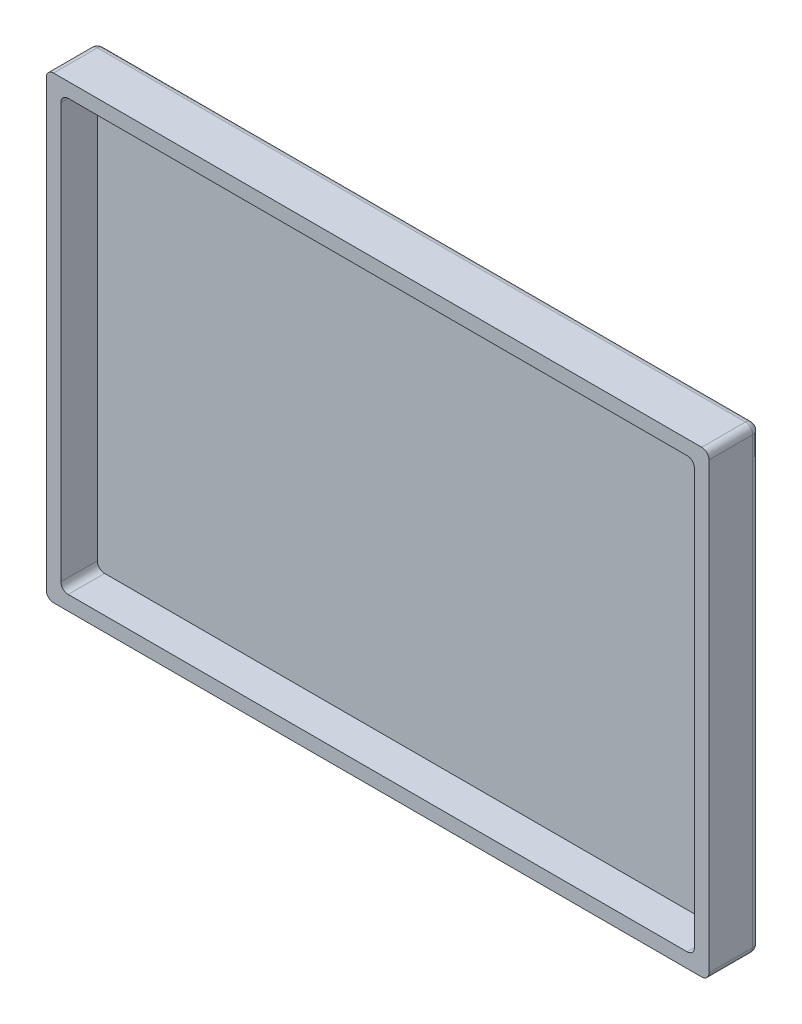
ISO-10303-21;
HEADER;
FILE_DESCRIPTION(('STEP AP214'),'2;1');
FILE_NAME('part.step','',(''),(''),'','','');
FILE_SCHEMA(('AUTOMOTIVE_DESIGN { 1 0 10303 214 1 1 1 1 }'));
ENDSEC;
DATA;
#1=APPLICATION_CONTEXT('core data for automotive mechanical design processes');
#2=APPLICATION_PROTOCOL_DEFINITION('international standard','automotive_design',2000,#1);
#3=PRODUCT_CONTEXT('',#1,'mechanical');
#4=PRODUCT('Part','Part','',(#3));
#5=PRODUCT_RELATED_PRODUCT_CATEGORY('part','',(#4));
#6=PRODUCT_DEFINITION_FORMATION('','',#4);
#7=PRODUCT_DEFINITION_CONTEXT('part definition',#1,'design');
#8=PRODUCT_DEFINITION('design','',#6,#7);
#9=PRODUCT_DEFINITION_SHAPE('','',#8);
#10=(LENGTH_UNIT() NAMED_UNIT(*) SI_UNIT(.MILLI.,.METRE.));
#11=(NAMED_UNIT(*) PLANE_ANGLE_UNIT() SI_UNIT($,.RADIAN.));
#12=(NAMED_UNIT(*) SI_UNIT($,.STERADIAN.) SOLID_ANGLE_UNIT());
#13=UNCERTAINTY_MEASURE_WITH_UNIT(LENGTH_MEASURE(1.E-05),#10,'distance_accuracy_value','');
#14=(GEOMETRIC_REPRESENTATION_CONTEXT(3) GLOBAL_UNCERTAINTY_ASSIGNED_CONTEXT((#13)) GLOBAL_UNIT_ASSIGNED_CONTEXT((#10,
#11,#12)) REPRESENTATION_CONTEXT('',''));
#15=CARTESIAN_POINT('',(0.,0.,0.));
#16=DIRECTION('',(0.,0.,1.));
#17=DIRECTION('',(1.,0.,0.));
#18=AXIS2_PLACEMENT_3D('',#15,#16,#17);
#19=CARTESIAN_POINT('',(0.,0.,5.));
#20=DIRECTION('',(0.,0.,1.));
#21=DIRECTION('',(1.,0.,0.));
#22=AXIS2_PLACEMENT_3D('',#19,#20,#21);
#23=PLANE('',#22);
#24=DIRECTION('',(1.,0.,0.));
#25=VECTOR('',#24,1.);
#26=CARTESIAN_POINT('',(-46.7633401137233,-46.7014218009479,5.));
#27=LINE('',#26,#25);
#28=CARTESIAN_POINT('',(-45.7633401137233,-46.7014218009479,5.));
#29=VERTEX_POINT('',#28);
#30=CARTESIAN_POINT('',(43.2366598862767,-46.7014218009479,5.));
#31=VERTEX_POINT('',#30);
#32=EDGE_CURVE('E367',#29,#31,#27,.T.);
#33=ORIENTED_EDGE('',*,*,#32,.T.);
#34=CARTESIAN_POINT('',(43.2366598862767,-45.7014218009479,5.));
#35=DIRECTION('',(0.,0.,1.));
#36=DIRECTION('',(1.,0.,0.));
#37=AXIS2_PLACEMENT_3D('',#34,#35,#36);
#38=CIRCLE('',#37,1.);
#39=CARTESIAN_POINT('',(44.2366598862767,-45.7014218009479,5.));
#40=VERTEX_POINT('',#39);
#41=EDGE_CURVE('E273',#31,#40,#38,.T.);
#42=ORIENTED_EDGE('',*,*,#41,.T.);
#43=DIRECTION('',(0.,1.,0.));
#44=VECTOR('',#43,1.);
#45=CARTESIAN_POINT('',(44.2366598862767,16.2985781990521,5.));
#46=LINE('',#45,#44);
#47=CARTESIAN_POINT('',(44.2366598862767,15.2985781990521,5.));
#48=VERTEX_POINT('',#47);
#49=EDGE_CURVE('E200',#40,#48,#46,.T.);
#50=ORIENTED_EDGE('',*,*,#49,.T.);
#51=CARTESIAN_POINT('',(43.2366598862767,15.2985781990521,5.));
#52=DIRECTION('',(0.,0.,1.));
#53=DIRECTION('',(1.,0.,0.));
#54=AXIS2_PLACEMENT_3D('',#51,#52,#53);
#55=CIRCLE('',#54,1.);
#56=CARTESIAN_POINT('',(43.2366598862767,16.2985781990521,5.));
#57=VERTEX_POINT('',#56);
#58=EDGE_CURVE('E270',#48,#57,#55,.T.);
#59=ORIENTED_EDGE('',*,*,#58,.T.);
#60=DIRECTION('',(-1.,0.,0.));
#61=VECTOR('',#60,1.);
#62=CARTESIAN_POINT('',(-46.7633401137233,16.2985781990521,5.));
#63=LINE('',#62,#61);
#64=CARTESIAN_POINT('',(-45.7633401137233,16.2985781990521,5.));
#65=VERTEX_POINT('',#64);
#66=EDGE_CURVE('E196',#57,#65,#63,.T.);
#67=ORIENTED_EDGE('',*,*,#66,.T.);
#68=CARTESIAN_POINT('',(-45.7633401137233,15.2985781990521,5.));
#69=DIRECTION('',(0.,0.,1.));
#70=DIRECTION('',(1.,0.,0.));
#71=AXIS2_PLACEMENT_3D('',#68,#69,#70);
#72=CIRCLE('',#71,1.);
#73=CARTESIAN_POINT('',(-46.7633401137233,15.2985781990521,5.));
#74=VERTEX_POINT('',#73);
#75=EDGE_CURVE('E267',#65,#74,#72,.T.);
#76=ORIENTED_EDGE('',*,*,#75,.T.);
#77=DIRECTION('',(0.,-1.,0.));
#78=VECTOR('',#77,1.);
#79=CARTESIAN_POINT('',(-46.7633401137233,16.2985781990521,5.));
#80=LINE('',#79,#78);
#81=CARTESIAN_POINT('',(-46.7633401137233,-45.7014218009479,5.));
#82=VERTEX_POINT('',#81);
#83=EDGE_CURVE('E363',#74,#82,#80,.T.);
#84=ORIENTED_EDGE('',*,*,#83,.T.);
#85=CARTESIAN_POINT('',(-45.7633401137233,-45.7014218009479,5.));
#86=DIRECTION('',(0.,0.,1.));
#87=DIRECTION('',(1.,0.,0.));
#88=AXIS2_PLACEMENT_3D('',#85,#86,#87);
#89=CIRCLE('',#88,1.);
#90=EDGE_CURVE('E254',#82,#29,#89,.T.);
#91=ORIENTED_EDGE('',*,*,#90,.T.);
#92=EDGE_LOOP('',(#33,#42,#50,#59,#67,#76,#84,#91));
#93=FACE_BOUND('',#92,.T.);
#94=DIRECTION('',(1.,0.,0.));
#95=VECTOR('',#94,1.);
#96=CARTESIAN_POINT('',(-44.7633401137233,-44.7014218009479,5.));
#97=LINE('',#96,#95);
#98=CARTESIAN_POINT('',(-43.7633401137233,-44.7014218009479,5.));
#99=VERTEX_POINT('',#98);
#100=CARTESIAN_POINT('',(41.2366598862767,-44.7014218009479,5.));
#101=VERTEX_POINT('',#100);
#102=EDGE_CURVE('E686',#99,#101,#97,.T.);
#103=ORIENTED_EDGE('',*,*,#102,.F.);
#104=CARTESIAN_POINT('',(-43.7633401137233,-43.7014218009479,5.));
#105=DIRECTION('',(0.,0.,1.));
#106=DIRECTION('',(1.,0.,0.));
#107=AXIS2_PLACEMENT_3D('',#104,#105,#106);
#108=CIRCLE('',#107,1.);
#109=CARTESIAN_POINT('',(-44.7633401137233,-43.7014218009478,5.));
#110=VERTEX_POINT('',#109);
#111=EDGE_CURVE('E241',#99,#110,#108,.F.);
#112=ORIENTED_EDGE('',*,*,#111,.T.);
#113=DIRECTION('',(0.,-1.,0.));
#114=VECTOR('',#113,1.);
#115=CARTESIAN_POINT('',(-44.7633401137233,14.2985781990521,5.));
#116=LINE('',#115,#114);
#117=CARTESIAN_POINT('',(-44.7633401137233,13.2985781990521,5.));
#118=VERTEX_POINT('',#117);
#119=EDGE_CURVE('E362',#118,#110,#116,.T.);
#120=ORIENTED_EDGE('',*,*,#119,.F.);
#121=CARTESIAN_POINT('',(-43.7633401137233,13.2985781990521,5.));
#122=DIRECTION('',(0.,0.,1.));
#123=DIRECTION('',(1.,0.,0.));
#124=AXIS2_PLACEMENT_3D('',#121,#122,#123);
#125=CIRCLE('',#124,1.);
#126=CARTESIAN_POINT('',(-43.7633401137233,14.2985781990521,5.));
#127=VERTEX_POINT('',#126);
#128=EDGE_CURVE('E238',#118,#127,#125,.F.);
#129=ORIENTED_EDGE('',*,*,#128,.T.);
#130=DIRECTION('',(-1.,0.,0.));
#131=VECTOR('',#130,1.);
#132=CARTESIAN_POINT('',(-44.7633401137233,14.2985781990521,5.));
#133=LINE('',#132,#131);
#134=CARTESIAN_POINT('',(41.2366598862767,14.2985781990521,5.));
#135=VERTEX_POINT('',#134);
#136=EDGE_CURVE('E357',#135,#127,#133,.T.);
#137=ORIENTED_EDGE('',*,*,#136,.F.);
#138=CARTESIAN_POINT('',(41.2366598862767,13.2985781990521,5.));
#139=DIRECTION('',(0.,0.,1.));
#140=DIRECTION('',(1.,0.,0.));
#141=AXIS2_PLACEMENT_3D('',#138,#139,#140);
#142=CIRCLE('',#141,1.);
#143=CARTESIAN_POINT('',(42.2366598862767,13.2985781990521,5.));
#144=VERTEX_POINT('',#143);
#145=EDGE_CURVE('E206',#135,#144,#142,.F.);
#146=ORIENTED_EDGE('',*,*,#145,.T.);
#147=DIRECTION('',(0.,1.,0.));
#148=VECTOR('',#147,1.);
#149=CARTESIAN_POINT('',(42.2366598862767,14.2985781990521,5.));
#150=LINE('',#149,#148);
#151=CARTESIAN_POINT('',(42.2366598862767,-43.7014218009479,5.));
#152=VERTEX_POINT('',#151);
#153=EDGE_CURVE('E193',#152,#144,#150,.T.);
#154=ORIENTED_EDGE('',*,*,#153,.F.);
#155=CARTESIAN_POINT('',(41.2366598862767,-43.7014218009479,5.));
#156=DIRECTION('',(0.,0.,1.));
#157=DIRECTION('',(1.,0.,0.));
#158=AXIS2_PLACEMENT_3D('',#155,#156,#157);
#159=CIRCLE('',#158,1.);
#160=EDGE_CURVE('E244',#152,#101,#159,.F.);
#161=ORIENTED_EDGE('',*,*,#160,.T.);
#162=EDGE_LOOP('',(#103,#112,#120,#129,#137,#146,#154,#161));
#163=FACE_BOUND('',#162,.T.);
#164=ADVANCED_FACE('F41',(#93,#163),#23,.T.);
#165=CARTESIAN_POINT('',(-46.7633401137233,16.2985781990521,5.));
#166=DIRECTION('',(1.,0.,0.));
#167=DIRECTION('',(0.,1.,0.));
#168=AXIS2_PLACEMENT_3D('',#165,#166,#167);
#169=PLANE('',#168);
#170=DIRECTION('',(0.,0.,-1.));
#171=VECTOR('',#170,1.);
#172=CARTESIAN_POINT('',(-46.7633401137233,15.2985781990521,5.));
#173=LINE('',#172,#171);
#174=CARTESIAN_POINT('',(-46.7633401137233,15.2985781990521,-1.));
#175=VERTEX_POINT('',#174);
#176=EDGE_CURVE('E283',#74,#175,#173,.T.);
#177=ORIENTED_EDGE('',*,*,#176,.T.);
#178=DIRECTION('',(0.,1.,0.));
#179=VECTOR('',#178,1.);
#180=CARTESIAN_POINT('',(-46.7633401137233,-45.7014218009479,-1.));
#181=LINE('',#180,#179);
#182=CARTESIAN_POINT('',(-46.7633401137233,-45.7014218009479,-1.));
#183=VERTEX_POINT('',#182);
#184=EDGE_CURVE('E310',#175,#183,#181,.F.);
#185=ORIENTED_EDGE('',*,*,#184,.T.);
#186=DIRECTION('',(0.,0.,-1.));
#187=VECTOR('',#186,1.);
#188=CARTESIAN_POINT('',(-46.7633401137233,-45.7014218009479,5.));
#189=LINE('',#188,#187);
#190=EDGE_CURVE('E251',#183,#82,#189,.F.);
#191=ORIENTED_EDGE('',*,*,#190,.T.);
#192=ORIENTED_EDGE('',*,*,#83,.F.);
#193=EDGE_LOOP('',(#177,#185,#191,#192));
#194=FACE_BOUND('',#193,.T.);
#195=ADVANCED_FACE('F413',(#194),#169,.F.);
#196=CARTESIAN_POINT('',(-46.7633401137233,-46.7014218009479,5.));
#197=DIRECTION('',(0.,1.,0.));
#198=DIRECTION('',(0.,0.,1.));
#199=AXIS2_PLACEMENT_3D('',#196,#197,#198);
#200=PLANE('',#199);
#201=DIRECTION('',(0.,0.,-1.));
#202=VECTOR('',#201,1.);
#203=CARTESIAN_POINT('',(-45.7633401137233,-46.7014218009479,5.));
#204=LINE('',#203,#202);
#205=CARTESIAN_POINT('',(-45.7633401137233,-46.7014218009479,-1.));
#206=VERTEX_POINT('',#205);
#207=EDGE_CURVE('E247',#29,#206,#204,.T.);
#208=ORIENTED_EDGE('',*,*,#207,.T.);
#209=DIRECTION('',(-1.,0.,0.));
#210=VECTOR('',#209,1.);
#211=CARTESIAN_POINT('',(43.2366598862767,-46.7014218009479,-1.));
#212=LINE('',#211,#210);
#213=CARTESIAN_POINT('',(43.2366598862767,-46.7014218009479,-1.));
#214=VERTEX_POINT('',#213);
#215=EDGE_CURVE('E313',#206,#214,#212,.F.);
#216=ORIENTED_EDGE('',*,*,#215,.T.);
#217=DIRECTION('',(0.,0.,-1.));
#218=VECTOR('',#217,1.);
#219=CARTESIAN_POINT('',(43.2366598862767,-46.7014218009479,5.));
#220=LINE('',#219,#218);
#221=EDGE_CURVE('E264',#214,#31,#220,.F.);
#222=ORIENTED_EDGE('',*,*,#221,.T.);
#223=ORIENTED_EDGE('',*,*,#32,.F.);
#224=EDGE_LOOP('',(#208,#216,#222,#223));
#225=FACE_BOUND('',#224,.T.);
#226=ADVANCED_FACE('F421',(#225),#200,.F.);
#227=CARTESIAN_POINT('',(44.2366598862767,16.2985781990521,5.));
#228=DIRECTION('',(-1.,0.,0.));
#229=DIRECTION('',(0.,-1.,0.));
#230=AXIS2_PLACEMENT_3D('',#227,#228,#229);
#231=PLANE('',#230);
#232=DIRECTION('',(0.,0.,-1.));
#233=VECTOR('',#232,1.);
#234=CARTESIAN_POINT('',(44.2366598862767,-45.7014218009479,5.));
#235=LINE('',#234,#233);
#236=CARTESIAN_POINT('',(44.2366598862767,-45.7014218009479,-1.));
#237=VERTEX_POINT('',#236);
#238=EDGE_CURVE('E260',#40,#237,#235,.T.);
#239=ORIENTED_EDGE('',*,*,#238,.T.);
#240=DIRECTION('',(0.,-1.,0.));
#241=VECTOR('',#240,1.);
#242=CARTESIAN_POINT('',(44.2366598862767,15.2985781990521,-1.));
#243=LINE('',#242,#241);
#244=CARTESIAN_POINT('',(44.2366598862767,15.2985781990521,-1.));
#245=VERTEX_POINT('',#244);
#246=EDGE_CURVE('E51',#237,#245,#243,.F.);
#247=ORIENTED_EDGE('',*,*,#246,.T.);
#248=DIRECTION('',(0.,0.,-1.));
#249=VECTOR('',#248,1.);
#250=CARTESIAN_POINT('',(44.2366598862767,15.2985781990521,5.));
#251=LINE('',#250,#249);
#252=EDGE_CURVE('E257',#245,#48,#251,.F.);
#253=ORIENTED_EDGE('',*,*,#252,.T.);
#254=ORIENTED_EDGE('',*,*,#49,.F.);
#255=EDGE_LOOP('',(#239,#247,#253,#254));
#256=FACE_BOUND('',#255,.T.);
#257=ADVANCED_FACE('F447',(#256),#231,.F.);
#258=CARTESIAN_POINT('',(-46.7633401137233,16.2985781990521,5.));
#259=DIRECTION('',(0.,-1.,0.));
#260=DIRECTION('',(0.,0.,-1.));
#261=AXIS2_PLACEMENT_3D('',#258,#259,#260);
#262=PLANE('',#261);
#263=DIRECTION('',(0.,0.,-1.));
#264=VECTOR('',#263,1.);
#265=CARTESIAN_POINT('',(43.2366598862767,16.2985781990521,5.));
#266=LINE('',#265,#264);
#267=CARTESIAN_POINT('',(43.2366598862767,16.2985781990521,-1.));
#268=VERTEX_POINT('',#267);
#269=EDGE_CURVE('E279',#57,#268,#266,.T.);
#270=ORIENTED_EDGE('',*,*,#269,.T.);
#271=DIRECTION('',(1.,0.,0.));
#272=VECTOR('',#271,1.);
#273=CARTESIAN_POINT('',(-45.7633401137233,16.2985781990521,-1.));
#274=LINE('',#273,#272);
#275=CARTESIAN_POINT('',(-45.7633401137233,16.2985781990521,-1.));
#276=VERTEX_POINT('',#275);
#277=EDGE_CURVE('E11',#268,#276,#274,.F.);
#278=ORIENTED_EDGE('',*,*,#277,.T.);
#279=DIRECTION('',(0.,0.,-1.));
#280=VECTOR('',#279,1.);
#281=CARTESIAN_POINT('',(-45.7633401137233,16.2985781990521,5.));
#282=LINE('',#281,#280);
#283=EDGE_CURVE('E276',#276,#65,#282,.F.);
#284=ORIENTED_EDGE('',*,*,#283,.T.);
#285=ORIENTED_EDGE('',*,*,#66,.F.);
#286=EDGE_LOOP('',(#270,#278,#284,#285));
#287=FACE_BOUND('',#286,.T.);
#288=ADVANCED_FACE('F388',(#287),#262,.F.);
#289=CARTESIAN_POINT('',(-44.7633401137233,14.2985781990521,5.));
#290=DIRECTION('',(1.,0.,0.));
#291=DIRECTION('',(0.,0.,-1.));
#292=AXIS2_PLACEMENT_3D('',#289,#290,#291);
#293=PLANE('',#292);
#294=DIRECTION('',(0.,-1.,0.));
#295=VECTOR('',#294,1.);
#296=CARTESIAN_POINT('',(-44.7633401137233,14.2985781990521,0.));
#297=LINE('',#296,#295);
#298=CARTESIAN_POINT('',(-44.7633401137233,13.2985781990521,0.));
#299=VERTEX_POINT('',#298);
#300=CARTESIAN_POINT('',(-44.7633401137233,-43.7014218009478,0.));
#301=VERTEX_POINT('',#300);
#302=EDGE_CURVE('E347',#299,#301,#297,.T.);
#303=ORIENTED_EDGE('',*,*,#302,.F.);
#304=DIRECTION('',(0.,0.,-1.));
#305=VECTOR('',#304,1.);
#306=CARTESIAN_POINT('',(-44.7633401137233,13.2985781990521,5.));
#307=LINE('',#306,#305);
#308=EDGE_CURVE('E225',#299,#118,#307,.F.);
#309=ORIENTED_EDGE('',*,*,#308,.T.);
#310=ORIENTED_EDGE('',*,*,#119,.T.);
#311=DIRECTION('',(0.,0.,-1.));
#312=VECTOR('',#311,1.);
#313=CARTESIAN_POINT('',(-44.7633401137233,-43.7014218009479,0.));
#314=LINE('',#313,#312);
#315=EDGE_CURVE('E221',#110,#301,#314,.T.);
#316=ORIENTED_EDGE('',*,*,#315,.T.);
#317=EDGE_LOOP('',(#303,#309,#310,#316));
#318=FACE_BOUND('',#317,.T.);
#319=ADVANCED_FACE('F443',(#318),#293,.T.);
#320=CARTESIAN_POINT('',(-44.7633401137233,-44.7014218009479,5.));
#321=DIRECTION('',(0.,1.,0.));
#322=DIRECTION('',(-1.,0.,0.));
#323=AXIS2_PLACEMENT_3D('',#320,#321,#322);
#324=PLANE('',#323);
#325=DIRECTION('',(1.,0.,0.));
#326=VECTOR('',#325,1.);
#327=CARTESIAN_POINT('',(-44.7633401137233,-44.7014218009479,0.));
#328=LINE('',#327,#326);
#329=CARTESIAN_POINT('',(-43.7633401137233,-44.7014218009479,0.));
#330=VERTEX_POINT('',#329);
#331=CARTESIAN_POINT('',(41.2366598862767,-44.7014218009479,0.));
#332=VERTEX_POINT('',#331);
#333=EDGE_CURVE('E180',#330,#332,#328,.T.);
#334=ORIENTED_EDGE('',*,*,#333,.F.);
#335=DIRECTION('',(0.,0.,-1.));
#336=VECTOR('',#335,1.);
#337=CARTESIAN_POINT('',(-43.7633401137233,-44.7014218009479,5.));
#338=LINE('',#337,#336);
#339=EDGE_CURVE('E232',#330,#99,#338,.F.);
#340=ORIENTED_EDGE('',*,*,#339,.T.);
#341=ORIENTED_EDGE('',*,*,#102,.T.);
#342=DIRECTION('',(0.,0.,-1.));
#343=VECTOR('',#342,1.);
#344=CARTESIAN_POINT('',(41.2366598862767,-44.7014218009479,0.));
#345=LINE('',#344,#343);
#346=EDGE_CURVE('E228',#101,#332,#345,.T.);
#347=ORIENTED_EDGE('',*,*,#346,.T.);
#348=EDGE_LOOP('',(#334,#340,#341,#347));
#349=FACE_BOUND('',#348,.T.);
#350=ADVANCED_FACE('F640',(#349),#324,.T.);
#351=CARTESIAN_POINT('',(42.2366598862767,14.2985781990521,5.));
#352=DIRECTION('',(-1.,0.,0.));
#353=DIRECTION('',(0.,0.,1.));
#354=AXIS2_PLACEMENT_3D('',#351,#352,#353);
#355=PLANE('',#354);
#356=DIRECTION('',(0.,1.,0.));
#357=VECTOR('',#356,1.);
#358=CARTESIAN_POINT('',(42.2366598862767,14.2985781990521,0.));
#359=LINE('',#358,#357);
#360=CARTESIAN_POINT('',(42.2366598862767,-43.7014218009479,0.));
#361=VERTEX_POINT('',#360);
#362=CARTESIAN_POINT('',(42.2366598862767,13.2985781990521,0.));
#363=VERTEX_POINT('',#362);
#364=EDGE_CURVE('E167',#361,#363,#359,.T.);
#365=ORIENTED_EDGE('',*,*,#364,.F.);
#366=DIRECTION('',(0.,0.,-1.));
#367=VECTOR('',#366,1.);
#368=CARTESIAN_POINT('',(42.2366598862767,-43.7014218009479,5.));
#369=LINE('',#368,#367);
#370=EDGE_CURVE('E235',#361,#152,#369,.F.);
#371=ORIENTED_EDGE('',*,*,#370,.T.);
#372=ORIENTED_EDGE('',*,*,#153,.T.);
#373=DIRECTION('',(0.,0.,-1.));
#374=VECTOR('',#373,1.);
#375=CARTESIAN_POINT('',(42.2366598862767,13.2985781990521,0.));
#376=LINE('',#375,#374);
#377=EDGE_CURVE('E187',#144,#363,#376,.T.);
#378=ORIENTED_EDGE('',*,*,#377,.T.);
#379=EDGE_LOOP('',(#365,#371,#372,#378));
#380=FACE_BOUND('',#379,.T.);
#381=ADVANCED_FACE('F191',(#380),#355,.T.);
#382=CARTESIAN_POINT('',(-44.7633401137233,14.2985781990521,5.));
#383=DIRECTION('',(0.,-1.,0.));
#384=DIRECTION('',(0.,0.,-1.));
#385=AXIS2_PLACEMENT_3D('',#382,#383,#384);
#386=PLANE('',#385);
#387=ORIENTED_EDGE('',*,*,#136,.T.);
#388=DIRECTION('',(0.,0.,-1.));
#389=VECTOR('',#388,1.);
#390=CARTESIAN_POINT('',(-43.7633401137233,14.2985781990521,0.));
#391=LINE('',#390,#389);
#392=CARTESIAN_POINT('',(-43.7633401137233,14.2985781990521,0.));
#393=VERTEX_POINT('',#392);
#394=EDGE_CURVE('E209',#127,#393,#391,.T.);
#395=ORIENTED_EDGE('',*,*,#394,.T.);
#396=DIRECTION('',(-1.,0.,0.));
#397=VECTOR('',#396,1.);
#398=CARTESIAN_POINT('',(-44.7633401137233,14.2985781990521,0.));
#399=LINE('',#398,#397);
#400=CARTESIAN_POINT('',(41.2366598862767,14.2985781990521,0.));
#401=VERTEX_POINT('',#400);
#402=EDGE_CURVE('E179',#401,#393,#399,.T.);
#403=ORIENTED_EDGE('',*,*,#402,.F.);
#404=DIRECTION('',(0.,0.,-1.));
#405=VECTOR('',#404,1.);
#406=CARTESIAN_POINT('',(41.2366598862767,14.2985781990521,5.));
#407=LINE('',#406,#405);
#408=EDGE_CURVE('E188',#401,#135,#407,.F.);
#409=ORIENTED_EDGE('',*,*,#408,.T.);
#410=EDGE_LOOP('',(#387,#395,#403,#409));
#411=FACE_BOUND('',#410,.T.);
#412=ADVANCED_FACE('F591',(#411),#386,.T.);
#413=CARTESIAN_POINT('',(0.,0.,0.));
#414=DIRECTION('',(0.,0.,-1.));
#415=DIRECTION('',(-1.,0.,0.));
#416=AXIS2_PLACEMENT_3D('',#413,#414,#415);
#417=PLANE('',#416);
#418=ORIENTED_EDGE('',*,*,#402,.T.);
#419=CARTESIAN_POINT('',(-43.7633401137233,13.2985781990521,0.));
#420=DIRECTION('',(0.,0.,-1.));
#421=DIRECTION('',(-1.,0.,0.));
#422=AXIS2_PLACEMENT_3D('',#419,#420,#421);
#423=CIRCLE('',#422,1.);
#424=EDGE_CURVE('E218',#393,#299,#423,.F.);
#425=ORIENTED_EDGE('',*,*,#424,.T.);
#426=ORIENTED_EDGE('',*,*,#302,.T.);
#427=CARTESIAN_POINT('',(-43.7633401137233,-43.7014218009479,0.));
#428=DIRECTION('',(0.,0.,-1.));
#429=DIRECTION('',(-1.,0.,0.));
#430=AXIS2_PLACEMENT_3D('',#427,#428,#429);
#431=CIRCLE('',#430,1.);
#432=EDGE_CURVE('E215',#301,#330,#431,.F.);
#433=ORIENTED_EDGE('',*,*,#432,.T.);
#434=ORIENTED_EDGE('',*,*,#333,.T.);
#435=CARTESIAN_POINT('',(41.2366598862767,-43.7014218009479,0.));
#436=DIRECTION('',(0.,0.,-1.));
#437=DIRECTION('',(-1.,0.,0.));
#438=AXIS2_PLACEMENT_3D('',#435,#436,#437);
#439=CIRCLE('',#438,1.);
#440=EDGE_CURVE('E174',#332,#361,#439,.F.);
#441=ORIENTED_EDGE('',*,*,#440,.T.);
#442=ORIENTED_EDGE('',*,*,#364,.T.);
#443=CARTESIAN_POINT('',(41.2366598862767,13.2985781990521,0.));
#444=DIRECTION('',(0.,0.,-1.));
#445=DIRECTION('',(-1.,0.,0.));
#446=AXIS2_PLACEMENT_3D('',#443,#444,#445);
#447=CIRCLE('',#446,1.);
#448=EDGE_CURVE('E171',#363,#401,#447,.F.);
#449=ORIENTED_EDGE('',*,*,#448,.T.);
#450=EDGE_LOOP('',(#418,#425,#426,#433,#434,#441,#442,#449));
#451=FACE_BOUND('',#450,.T.);
#452=ADVANCED_FACE('F170',(#451),#417,.F.);
#453=CARTESIAN_POINT('',(0.,0.,-2.));
#454=DIRECTION('',(0.,0.,-1.));
#455=DIRECTION('',(-1.,0.,0.));
#456=AXIS2_PLACEMENT_3D('',#453,#454,#455);
#457=PLANE('',#456);
#458=DIRECTION('',(-1.,0.,0.));
#459=VECTOR('',#458,1.);
#460=CARTESIAN_POINT('',(-45.7633401137233,-45.7014218009479,-2.));
#461=LINE('',#460,#459);
#462=CARTESIAN_POINT('',(43.2366598862767,-45.7014218009479,-2.));
#463=VERTEX_POINT('',#462);
#464=CARTESIAN_POINT('',(-45.7633401137233,-45.7014218009479,-2.));
#465=VERTEX_POINT('',#464);
#466=EDGE_CURVE('E59',#463,#465,#461,.T.);
#467=ORIENTED_EDGE('',*,*,#466,.T.);
#468=DIRECTION('',(0.,1.,0.));
#469=VECTOR('',#468,1.);
#470=CARTESIAN_POINT('',(-45.7633401137233,15.2985781990521,-2.));
#471=LINE('',#470,#469);
#472=CARTESIAN_POINT('',(-45.7633401137233,15.2985781990521,-2.));
#473=VERTEX_POINT('',#472);
#474=EDGE_CURVE('E307',#465,#473,#471,.T.);
#475=ORIENTED_EDGE('',*,*,#474,.T.);
#476=DIRECTION('',(1.,0.,0.));
#477=VECTOR('',#476,1.);
#478=CARTESIAN_POINT('',(43.2366598862767,15.2985781990521,-2.));
#479=LINE('',#478,#477);
#480=CARTESIAN_POINT('',(43.2366598862767,15.2985781990521,-2.));
#481=VERTEX_POINT('',#480);
#482=EDGE_CURVE('E300',#473,#481,#479,.T.);
#483=ORIENTED_EDGE('',*,*,#482,.T.);
#484=DIRECTION('',(0.,-1.,0.));
#485=VECTOR('',#484,1.);
#486=CARTESIAN_POINT('',(43.2366598862767,-45.7014218009479,-2.));
#487=LINE('',#486,#485);
#488=EDGE_CURVE('E64',#481,#463,#487,.T.);
#489=ORIENTED_EDGE('',*,*,#488,.T.);
#490=EDGE_LOOP('',(#467,#475,#483,#489));
#491=FACE_BOUND('',#490,.T.);
#492=ADVANCED_FACE('F455',(#491),#457,.T.);
#493=CARTESIAN_POINT('',(41.2366598862767,13.2985781990521,5.));
#494=DIRECTION('',(0.,0.,1.));
#495=DIRECTION('',(1.,0.,0.));
#496=AXIS2_PLACEMENT_3D('',#493,#494,#495);
#497=CYLINDRICAL_SURFACE('',#496,1.);
#498=ORIENTED_EDGE('',*,*,#145,.F.);
#499=ORIENTED_EDGE('',*,*,#408,.F.);
#500=ORIENTED_EDGE('',*,*,#448,.F.);
#501=ORIENTED_EDGE('',*,*,#377,.F.);
#502=EDGE_LOOP('',(#498,#499,#500,#501));
#503=FACE_BOUND('',#502,.T.);
#504=ADVANCED_FACE('F186',(#503),#497,.F.);
#505=CARTESIAN_POINT('',(-43.7633401137233,13.2985781990521,5.));
#506=DIRECTION('',(0.,0.,1.));
#507=DIRECTION('',(1.,0.,0.));
#508=AXIS2_PLACEMENT_3D('',#505,#506,#507);
#509=CYLINDRICAL_SURFACE('',#508,1.);
#510=ORIENTED_EDGE('',*,*,#128,.F.);
#511=ORIENTED_EDGE('',*,*,#308,.F.);
#512=ORIENTED_EDGE('',*,*,#424,.F.);
#513=ORIENTED_EDGE('',*,*,#394,.F.);
#514=EDGE_LOOP('',(#510,#511,#512,#513));
#515=FACE_BOUND('',#514,.T.);
#516=ADVANCED_FACE('F454',(#515),#509,.F.);
#517=CARTESIAN_POINT('',(-43.7633401137233,-43.7014218009479,5.));
#518=DIRECTION('',(0.,0.,1.));
#519=DIRECTION('',(1.,0.,0.));
#520=AXIS2_PLACEMENT_3D('',#517,#518,#519);
#521=CYLINDRICAL_SURFACE('',#520,1.);
#522=ORIENTED_EDGE('',*,*,#111,.F.);
#523=ORIENTED_EDGE('',*,*,#339,.F.);
#524=ORIENTED_EDGE('',*,*,#432,.F.);
#525=ORIENTED_EDGE('',*,*,#315,.F.);
#526=EDGE_LOOP('',(#522,#523,#524,#525));
#527=FACE_BOUND('',#526,.T.);
#528=ADVANCED_FACE('F458',(#527),#521,.F.);
#529=CARTESIAN_POINT('',(41.2366598862767,-43.7014218009479,5.));
#530=DIRECTION('',(0.,0.,1.));
#531=DIRECTION('',(1.,0.,0.));
#532=AXIS2_PLACEMENT_3D('',#529,#530,#531);
#533=CYLINDRICAL_SURFACE('',#532,1.);
#534=ORIENTED_EDGE('',*,*,#160,.F.);
#535=ORIENTED_EDGE('',*,*,#370,.F.);
#536=ORIENTED_EDGE('',*,*,#440,.F.);
#537=ORIENTED_EDGE('',*,*,#346,.F.);
#538=EDGE_LOOP('',(#534,#535,#536,#537));
#539=FACE_BOUND('',#538,.T.);
#540=ADVANCED_FACE('F462',(#539),#533,.F.);
#541=CARTESIAN_POINT('',(-45.7633401137233,-45.7014218009479,5.));
#542=DIRECTION('',(0.,0.,-1.));
#543=DIRECTION('',(-1.,0.,0.));
#544=AXIS2_PLACEMENT_3D('',#541,#542,#543);
#545=CYLINDRICAL_SURFACE('',#544,1.);
#546=ORIENTED_EDGE('',*,*,#190,.F.);
#547=CARTESIAN_POINT('',(-45.7633401137233,-45.7014218009479,-1.));
#548=DIRECTION('',(0.,0.,-1.));
#549=DIRECTION('',(-1.,0.,0.));
#550=AXIS2_PLACEMENT_3D('',#547,#548,#549);
#551=CIRCLE('',#550,1.);
#552=EDGE_CURVE('E291',#183,#206,#551,.F.);
#553=ORIENTED_EDGE('',*,*,#552,.T.);
#554=ORIENTED_EDGE('',*,*,#207,.F.);
#555=ORIENTED_EDGE('',*,*,#90,.F.);
#556=EDGE_LOOP('',(#546,#553,#554,#555));
#557=FACE_BOUND('',#556,.T.);
#558=ADVANCED_FACE('F418',(#557),#545,.T.);
#559=CARTESIAN_POINT('',(43.2366598862767,-45.7014218009479,5.));
#560=DIRECTION('',(0.,0.,-1.));
#561=DIRECTION('',(-1.,0.,0.));
#562=AXIS2_PLACEMENT_3D('',#559,#560,#561);
#563=CYLINDRICAL_SURFACE('',#562,1.);
#564=ORIENTED_EDGE('',*,*,#221,.F.);
#565=CARTESIAN_POINT('',(43.2366598862767,-45.7014218009479,-1.));
#566=DIRECTION('',(0.,0.,-1.));
#567=DIRECTION('',(-1.,0.,0.));
#568=AXIS2_PLACEMENT_3D('',#565,#566,#567);
#569=CIRCLE('',#568,1.);
#570=EDGE_CURVE('E294',#214,#237,#569,.F.);
#571=ORIENTED_EDGE('',*,*,#570,.T.);
#572=ORIENTED_EDGE('',*,*,#238,.F.);
#573=ORIENTED_EDGE('',*,*,#41,.F.);
#574=EDGE_LOOP('',(#564,#571,#572,#573));
#575=FACE_BOUND('',#574,.T.);
#576=ADVANCED_FACE('F469',(#575),#563,.T.);
#577=CARTESIAN_POINT('',(43.2366598862767,15.2985781990521,5.));
#578=DIRECTION('',(0.,0.,-1.));
#579=DIRECTION('',(-1.,0.,0.));
#580=AXIS2_PLACEMENT_3D('',#577,#578,#579);
#581=CYLINDRICAL_SURFACE('',#580,1.);
#582=ORIENTED_EDGE('',*,*,#252,.F.);
#583=CARTESIAN_POINT('',(43.2366598862767,15.2985781990521,-1.));
#584=DIRECTION('',(0.,0.,-1.));
#585=DIRECTION('',(-1.,0.,0.));
#586=AXIS2_PLACEMENT_3D('',#583,#584,#585);
#587=CIRCLE('',#586,1.);
#588=EDGE_CURVE('E297',#245,#268,#587,.F.);
#589=ORIENTED_EDGE('',*,*,#588,.T.);
#590=ORIENTED_EDGE('',*,*,#269,.F.);
#591=ORIENTED_EDGE('',*,*,#58,.F.);
#592=EDGE_LOOP('',(#582,#589,#590,#591));
#593=FACE_BOUND('',#592,.T.);
#594=ADVANCED_FACE('F383',(#593),#581,.T.);
#595=CARTESIAN_POINT('',(-45.7633401137233,15.2985781990521,5.));
#596=DIRECTION('',(0.,0.,-1.));
#597=DIRECTION('',(-1.,0.,0.));
#598=AXIS2_PLACEMENT_3D('',#595,#596,#597);
#599=CYLINDRICAL_SURFACE('',#598,1.);
#600=ORIENTED_EDGE('',*,*,#283,.F.);
#601=CARTESIAN_POINT('',(-45.7633401137233,15.2985781990521,-1.));
#602=DIRECTION('',(0.,0.,-1.));
#603=DIRECTION('',(-1.,0.,0.));
#604=AXIS2_PLACEMENT_3D('',#601,#602,#603);
#605=CIRCLE('',#604,1.);
#606=EDGE_CURVE('E287',#276,#175,#605,.F.);
#607=ORIENTED_EDGE('',*,*,#606,.T.);
#608=ORIENTED_EDGE('',*,*,#176,.F.);
#609=ORIENTED_EDGE('',*,*,#75,.F.);
#610=EDGE_LOOP('',(#600,#607,#608,#609));
#611=FACE_BOUND('',#610,.T.);
#612=ADVANCED_FACE('F410',(#611),#599,.T.);
#613=CARTESIAN_POINT('',(43.2366598862767,-45.7014218009479,-1.));
#614=DIRECTION('',(0.,0.,-1.));
#615=DIRECTION('',(-1.,0.,0.));
#616=AXIS2_PLACEMENT_3D('',#613,#614,#615);
#617=SPHERICAL_SURFACE('',#616,1.);
#618=CARTESIAN_POINT('',(43.2366598862767,-45.7014218009479,-1.));
#619=DIRECTION('',(0.,1.,0.));
#620=DIRECTION('',(0.,0.,1.));
#621=AXIS2_PLACEMENT_3D('',#618,#619,#620);
#622=CIRCLE('',#621,1.);
#623=EDGE_CURVE('E339',#237,#463,#622,.T.);
#624=ORIENTED_EDGE('',*,*,#623,.F.);
#625=ORIENTED_EDGE('',*,*,#570,.F.);
#626=CARTESIAN_POINT('',(43.2366598862767,-45.7014218009479,-1.));
#627=DIRECTION('',(-1.,0.,0.));
#628=DIRECTION('',(0.,0.,1.));
#629=AXIS2_PLACEMENT_3D('',#626,#627,#628);
#630=CIRCLE('',#629,1.);
#631=EDGE_CURVE('E45',#463,#214,#630,.T.);
#632=ORIENTED_EDGE('',*,*,#631,.F.);
#633=EDGE_LOOP('',(#624,#625,#632));
#634=FACE_BOUND('',#633,.T.);
#635=ADVANCED_FACE('F43',(#634),#617,.T.);
#636=CARTESIAN_POINT('',(0.,-45.7014218009479,-1.));
#637=DIRECTION('',(1.,0.,0.));
#638=DIRECTION('',(0.,0.,-1.));
#639=AXIS2_PLACEMENT_3D('',#636,#637,#638);
#640=CYLINDRICAL_SURFACE('',#639,1.);
#641=ORIENTED_EDGE('',*,*,#631,.T.);
#642=ORIENTED_EDGE('',*,*,#215,.F.);
#643=CARTESIAN_POINT('',(-45.7633401137233,-45.7014218009479,-1.));
#644=DIRECTION('',(-1.,0.,0.));
#645=DIRECTION('',(0.,0.,1.));
#646=AXIS2_PLACEMENT_3D('',#643,#644,#645);
#647=CIRCLE('',#646,1.);
#648=EDGE_CURVE('E336',#465,#206,#647,.T.);
#649=ORIENTED_EDGE('',*,*,#648,.F.);
#650=ORIENTED_EDGE('',*,*,#466,.F.);
#651=EDGE_LOOP('',(#641,#642,#649,#650));
#652=FACE_BOUND('',#651,.T.);
#653=ADVANCED_FACE('F423',(#652),#640,.T.);
#654=CARTESIAN_POINT('',(43.2366598862767,0.,-1.));
#655=DIRECTION('',(0.,1.,0.));
#656=DIRECTION('',(-1.,0.,0.));
#657=AXIS2_PLACEMENT_3D('',#654,#655,#656);
#658=CYLINDRICAL_SURFACE('',#657,1.);
#659=ORIENTED_EDGE('',*,*,#623,.T.);
#660=ORIENTED_EDGE('',*,*,#488,.F.);
#661=CARTESIAN_POINT('',(43.2366598862767,15.2985781990521,-1.));
#662=DIRECTION('',(0.,1.,0.));
#663=DIRECTION('',(0.,0.,1.));
#664=AXIS2_PLACEMENT_3D('',#661,#662,#663);
#665=CIRCLE('',#664,1.);
#666=EDGE_CURVE('E332',#245,#481,#665,.T.);
#667=ORIENTED_EDGE('',*,*,#666,.F.);
#668=ORIENTED_EDGE('',*,*,#246,.F.);
#669=EDGE_LOOP('',(#659,#660,#667,#668));
#670=FACE_BOUND('',#669,.T.);
#671=ADVANCED_FACE('F427',(#670),#658,.T.);
#672=CARTESIAN_POINT('',(-45.7633401137233,-45.7014218009479,-1.));
#673=DIRECTION('',(0.,0.,-1.));
#674=DIRECTION('',(-1.,0.,0.));
#675=AXIS2_PLACEMENT_3D('',#672,#673,#674);
#676=SPHERICAL_SURFACE('',#675,1.);
#677=ORIENTED_EDGE('',*,*,#648,.T.);
#678=ORIENTED_EDGE('',*,*,#552,.F.);
#679=CARTESIAN_POINT('',(-45.7633401137233,-45.7014218009479,-1.));
#680=DIRECTION('',(0.,1.,0.));
#681=DIRECTION('',(0.,0.,1.));
#682=AXIS2_PLACEMENT_3D('',#679,#680,#681);
#683=CIRCLE('',#682,1.);
#684=EDGE_CURVE('E328',#465,#183,#683,.T.);
#685=ORIENTED_EDGE('',*,*,#684,.F.);
#686=EDGE_LOOP('',(#677,#678,#685));
#687=FACE_BOUND('',#686,.T.);
#688=ADVANCED_FACE('F425',(#687),#676,.T.);
#689=CARTESIAN_POINT('',(43.2366598862767,15.2985781990521,-1.));
#690=DIRECTION('',(0.,0.,-1.));
#691=DIRECTION('',(-1.,0.,0.));
#692=AXIS2_PLACEMENT_3D('',#689,#690,#691);
#693=SPHERICAL_SURFACE('',#692,1.);
#694=ORIENTED_EDGE('',*,*,#588,.F.);
#695=ORIENTED_EDGE('',*,*,#666,.T.);
#696=CARTESIAN_POINT('',(43.2366598862767,15.2985781990521,-1.));
#697=DIRECTION('',(-1.,0.,0.));
#698=DIRECTION('',(0.,0.,1.));
#699=AXIS2_PLACEMENT_3D('',#696,#697,#698);
#700=CIRCLE('',#699,1.);
#701=EDGE_CURVE('E324',#268,#481,#700,.T.);
#702=ORIENTED_EDGE('',*,*,#701,.F.);
#703=EDGE_LOOP('',(#694,#695,#702));
#704=FACE_BOUND('',#703,.T.);
#705=ADVANCED_FACE('F392',(#704),#693,.T.);
#706=CARTESIAN_POINT('',(-45.7633401137233,0.,-1.));
#707=DIRECTION('',(0.,-1.,0.));
#708=DIRECTION('',(1.,0.,0.));
#709=AXIS2_PLACEMENT_3D('',#706,#707,#708);
#710=CYLINDRICAL_SURFACE('',#709,1.);
#711=ORIENTED_EDGE('',*,*,#684,.T.);
#712=ORIENTED_EDGE('',*,*,#184,.F.);
#713=CARTESIAN_POINT('',(-45.7633401137233,15.2985781990521,-1.));
#714=DIRECTION('',(0.,1.,0.));
#715=DIRECTION('',(0.,0.,1.));
#716=AXIS2_PLACEMENT_3D('',#713,#714,#715);
#717=CIRCLE('',#716,1.);
#718=EDGE_CURVE('E321',#473,#175,#717,.T.);
#719=ORIENTED_EDGE('',*,*,#718,.F.);
#720=ORIENTED_EDGE('',*,*,#474,.F.);
#721=EDGE_LOOP('',(#711,#712,#719,#720));
#722=FACE_BOUND('',#721,.T.);
#723=ADVANCED_FACE('F404',(#722),#710,.T.);
#724=CARTESIAN_POINT('',(0.,15.2985781990521,-1.));
#725=DIRECTION('',(-1.,0.,0.));
#726=DIRECTION('',(0.,0.,1.));
#727=AXIS2_PLACEMENT_3D('',#724,#725,#726);
#728=CYLINDRICAL_SURFACE('',#727,1.);
#729=ORIENTED_EDGE('',*,*,#701,.T.);
#730=ORIENTED_EDGE('',*,*,#482,.F.);
#731=CARTESIAN_POINT('',(-45.7633401137233,15.2985781990521,-1.));
#732=DIRECTION('',(-1.,0.,0.));
#733=DIRECTION('',(0.,0.,1.));
#734=AXIS2_PLACEMENT_3D('',#731,#732,#733);
#735=CIRCLE('',#734,1.);
#736=EDGE_CURVE('E318',#276,#473,#735,.T.);
#737=ORIENTED_EDGE('',*,*,#736,.F.);
#738=ORIENTED_EDGE('',*,*,#277,.F.);
#739=EDGE_LOOP('',(#729,#730,#737,#738));
#740=FACE_BOUND('',#739,.T.);
#741=ADVANCED_FACE('F396',(#740),#728,.T.);
#742=CARTESIAN_POINT('',(-45.7633401137233,15.2985781990521,-1.));
#743=DIRECTION('',(0.,0.,-1.));
#744=DIRECTION('',(-1.,0.,0.));
#745=AXIS2_PLACEMENT_3D('',#742,#743,#744);
#746=SPHERICAL_SURFACE('',#745,1.);
#747=ORIENTED_EDGE('',*,*,#718,.T.);
#748=ORIENTED_EDGE('',*,*,#606,.F.);
#749=ORIENTED_EDGE('',*,*,#736,.T.);
#750=EDGE_LOOP('',(#747,#748,#749));
#751=FACE_BOUND('',#750,.T.);
#752=ADVANCED_FACE('F400',(#751),#746,.T.);
#753=CLOSED_SHELL('',(#164,#195,#226,#257,#288,#319,#350,#381,#412,#452,#492,#504,#516,#528,
#540,#558,#576,#594,#612,#635,#653,#671,#688,#705,#723,#741,#752));
#754=MANIFOLD_SOLID_BREP('B2',#753);
#755=ADVANCED_BREP_SHAPE_REPRESENTATION('',(#18,#754),#14);
#756=SHAPE_DEFINITION_REPRESENTATION(#9,#755);
ENDSEC;
END-ISO-10303-21;
